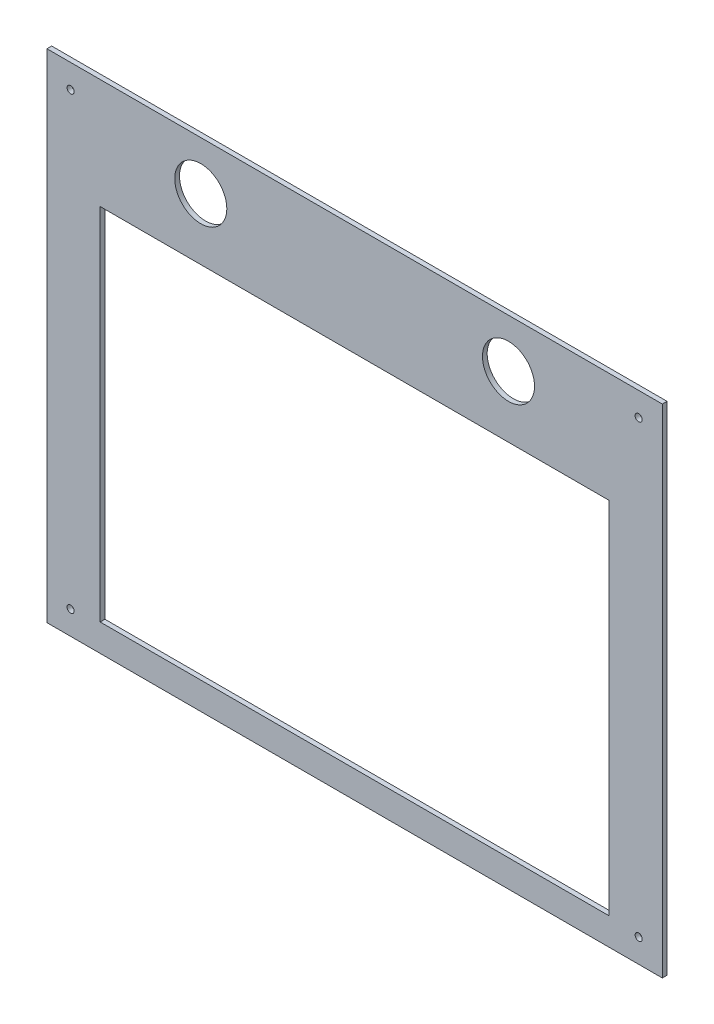
ISO-10303-21;
HEADER;
FILE_DESCRIPTION(('STEP AP214'),'2;1');
FILE_NAME('part.step','',(''),(''),'','','');
FILE_SCHEMA(('AUTOMOTIVE_DESIGN { 1 0 10303 214 1 1 1 1 }'));
ENDSEC;
DATA;
#1=APPLICATION_CONTEXT('core data for automotive mechanical design processes');
#2=APPLICATION_PROTOCOL_DEFINITION('international standard','automotive_design',2000,#1);
#3=PRODUCT_CONTEXT('',#1,'mechanical');
#4=PRODUCT('Part','Part','',(#3));
#5=PRODUCT_RELATED_PRODUCT_CATEGORY('part','',(#4));
#6=PRODUCT_DEFINITION_FORMATION('','',#4);
#7=PRODUCT_DEFINITION_CONTEXT('part definition',#1,'design');
#8=PRODUCT_DEFINITION('design','',#6,#7);
#9=PRODUCT_DEFINITION_SHAPE('','',#8);
#10=(LENGTH_UNIT() NAMED_UNIT(*) SI_UNIT(.MILLI.,.METRE.));
#11=(NAMED_UNIT(*) PLANE_ANGLE_UNIT() SI_UNIT($,.RADIAN.));
#12=(NAMED_UNIT(*) SI_UNIT($,.STERADIAN.) SOLID_ANGLE_UNIT());
#13=UNCERTAINTY_MEASURE_WITH_UNIT(LENGTH_MEASURE(1.E-05),#10,'distance_accuracy_value','');
#14=(GEOMETRIC_REPRESENTATION_CONTEXT(3) GLOBAL_UNCERTAINTY_ASSIGNED_CONTEXT((#13)) GLOBAL_UNIT_ASSIGNED_CONTEXT((#10,
#11,#12)) REPRESENTATION_CONTEXT('',''));
#15=CARTESIAN_POINT('',(0.,0.,0.));
#16=DIRECTION('',(0.,0.,1.));
#17=DIRECTION('',(1.,0.,0.));
#18=AXIS2_PLACEMENT_3D('',#15,#16,#17);
#19=CARTESIAN_POINT('',(0.,210.,2.));
#20=DIRECTION('',(1.,0.,0.));
#21=DIRECTION('',(0.,1.,0.));
#22=AXIS2_PLACEMENT_3D('',#19,#20,#21);
#23=PLANE('',#22);
#24=DIRECTION('',(0.,-1.,0.));
#25=VECTOR('',#24,1.);
#26=CARTESIAN_POINT('',(0.,210.,0.));
#27=LINE('',#26,#25);
#28=CARTESIAN_POINT('',(0.,210.,0.));
#29=VERTEX_POINT('',#28);
#30=CARTESIAN_POINT('',(0.,0.,0.));
#31=VERTEX_POINT('',#30);
#32=EDGE_CURVE('E152',#29,#31,#27,.T.);
#33=ORIENTED_EDGE('',*,*,#32,.T.);
#34=DIRECTION('',(0.,0.,-1.));
#35=VECTOR('',#34,1.);
#36=CARTESIAN_POINT('',(0.,0.,2.));
#37=LINE('',#36,#35);
#38=CARTESIAN_POINT('',(0.,0.,2.));
#39=VERTEX_POINT('',#38);
#40=EDGE_CURVE('E11',#39,#31,#37,.T.);
#41=ORIENTED_EDGE('',*,*,#40,.F.);
#42=DIRECTION('',(0.,-1.,0.));
#43=VECTOR('',#42,1.);
#44=CARTESIAN_POINT('',(0.,210.,2.));
#45=LINE('',#44,#43);
#46=CARTESIAN_POINT('',(0.,210.,2.));
#47=VERTEX_POINT('',#46);
#48=EDGE_CURVE('E155',#47,#39,#45,.T.);
#49=ORIENTED_EDGE('',*,*,#48,.F.);
#50=DIRECTION('',(0.,0.,-1.));
#51=VECTOR('',#50,1.);
#52=CARTESIAN_POINT('',(0.,210.,2.));
#53=LINE('',#52,#51);
#54=EDGE_CURVE('E165',#47,#29,#53,.T.);
#55=ORIENTED_EDGE('',*,*,#54,.T.);
#56=EDGE_LOOP('',(#33,#41,#49,#55));
#57=FACE_BOUND('',#56,.T.);
#58=ADVANCED_FACE('F36',(#57),#23,.F.);
#59=CARTESIAN_POINT('',(0.,0.,2.));
#60=DIRECTION('',(0.,1.,0.));
#61=DIRECTION('',(0.,0.,1.));
#62=AXIS2_PLACEMENT_3D('',#59,#60,#61);
#63=PLANE('',#62);
#64=DIRECTION('',(1.,0.,0.));
#65=VECTOR('',#64,1.);
#66=CARTESIAN_POINT('',(0.,0.,0.));
#67=LINE('',#66,#65);
#68=CARTESIAN_POINT('',(260.,0.,0.));
#69=VERTEX_POINT('',#68);
#70=EDGE_CURVE('E168',#31,#69,#67,.T.);
#71=ORIENTED_EDGE('',*,*,#70,.T.);
#72=DIRECTION('',(0.,0.,-1.));
#73=VECTOR('',#72,1.);
#74=CARTESIAN_POINT('',(260.,0.,2.));
#75=LINE('',#74,#73);
#76=CARTESIAN_POINT('',(260.,0.,2.));
#77=VERTEX_POINT('',#76);
#78=EDGE_CURVE('E44',#77,#69,#75,.T.);
#79=ORIENTED_EDGE('',*,*,#78,.F.);
#80=DIRECTION('',(1.,0.,0.));
#81=VECTOR('',#80,1.);
#82=CARTESIAN_POINT('',(0.,0.,2.));
#83=LINE('',#82,#81);
#84=EDGE_CURVE('E158',#39,#77,#83,.T.);
#85=ORIENTED_EDGE('',*,*,#84,.F.);
#86=ORIENTED_EDGE('',*,*,#40,.T.);
#87=EDGE_LOOP('',(#71,#79,#85,#86));
#88=FACE_BOUND('',#87,.T.);
#89=ADVANCED_FACE('F225',(#88),#63,.F.);
#90=CARTESIAN_POINT('',(260.,0.,2.));
#91=DIRECTION('',(-1.,0.,0.));
#92=DIRECTION('',(0.,0.,1.));
#93=AXIS2_PLACEMENT_3D('',#90,#91,#92);
#94=PLANE('',#93);
#95=DIRECTION('',(0.,1.,0.));
#96=VECTOR('',#95,1.);
#97=CARTESIAN_POINT('',(260.,0.,0.));
#98=LINE('',#97,#96);
#99=CARTESIAN_POINT('',(260.,210.,0.));
#100=VERTEX_POINT('',#99);
#101=EDGE_CURVE('E170',#69,#100,#98,.T.);
#102=ORIENTED_EDGE('',*,*,#101,.T.);
#103=DIRECTION('',(0.,0.,-1.));
#104=VECTOR('',#103,1.);
#105=CARTESIAN_POINT('',(260.,210.,2.));
#106=LINE('',#105,#104);
#107=CARTESIAN_POINT('',(260.,210.,2.));
#108=VERTEX_POINT('',#107);
#109=EDGE_CURVE('E175',#108,#100,#106,.T.);
#110=ORIENTED_EDGE('',*,*,#109,.F.);
#111=DIRECTION('',(0.,1.,0.));
#112=VECTOR('',#111,1.);
#113=CARTESIAN_POINT('',(260.,0.,2.));
#114=LINE('',#113,#112);
#115=EDGE_CURVE('E161',#77,#108,#114,.T.);
#116=ORIENTED_EDGE('',*,*,#115,.F.);
#117=ORIENTED_EDGE('',*,*,#78,.T.);
#118=EDGE_LOOP('',(#102,#110,#116,#117));
#119=FACE_BOUND('',#118,.T.);
#120=ADVANCED_FACE('F230',(#119),#94,.F.);
#121=CARTESIAN_POINT('',(260.,210.,2.));
#122=DIRECTION('',(0.,-1.,0.));
#123=DIRECTION('',(0.,0.,-1.));
#124=AXIS2_PLACEMENT_3D('',#121,#122,#123);
#125=PLANE('',#124);
#126=DIRECTION('',(-1.,0.,0.));
#127=VECTOR('',#126,1.);
#128=CARTESIAN_POINT('',(260.,210.,0.));
#129=LINE('',#128,#127);
#130=EDGE_CURVE('E159',#100,#29,#129,.T.);
#131=ORIENTED_EDGE('',*,*,#130,.T.);
#132=ORIENTED_EDGE('',*,*,#54,.F.);
#133=DIRECTION('',(-1.,0.,0.));
#134=VECTOR('',#133,1.);
#135=CARTESIAN_POINT('',(260.,210.,2.));
#136=LINE('',#135,#134);
#137=EDGE_CURVE('E163',#108,#47,#136,.T.);
#138=ORIENTED_EDGE('',*,*,#137,.F.);
#139=ORIENTED_EDGE('',*,*,#109,.T.);
#140=EDGE_LOOP('',(#131,#132,#138,#139));
#141=FACE_BOUND('',#140,.T.);
#142=ADVANCED_FACE('F208',(#141),#125,.F.);
#143=CARTESIAN_POINT('',(0.,0.,2.));
#144=DIRECTION('',(0.,0.,1.));
#145=DIRECTION('',(1.,0.,0.));
#146=AXIS2_PLACEMENT_3D('',#143,#144,#145);
#147=PLANE('',#146);
#148=CARTESIAN_POINT('',(250.,200.,2.));
#149=DIRECTION('',(0.,0.,1.));
#150=DIRECTION('',(1.,0.,0.));
#151=AXIS2_PLACEMENT_3D('',#148,#149,#150);
#152=CIRCLE('',#151,1.50000000000002);
#153=CARTESIAN_POINT('',(251.5,200.,2.));
#154=VERTEX_POINT('',#153);
#155=EDGE_CURVE('E193',#154,#154,#152,.T.);
#156=ORIENTED_EDGE('',*,*,#155,.F.);
#157=EDGE_LOOP('',(#156));
#158=FACE_BOUND('',#157,.T.);
#159=CARTESIAN_POINT('',(10.,200.,2.));
#160=DIRECTION('',(0.,0.,1.));
#161=DIRECTION('',(1.,0.,0.));
#162=AXIS2_PLACEMENT_3D('',#159,#160,#161);
#163=CIRCLE('',#162,1.5);
#164=CARTESIAN_POINT('',(11.5,200.,2.));
#165=VERTEX_POINT('',#164);
#166=EDGE_CURVE('E182',#165,#165,#163,.T.);
#167=ORIENTED_EDGE('',*,*,#166,.F.);
#168=EDGE_LOOP('',(#167));
#169=FACE_BOUND('',#168,.T.);
#170=CARTESIAN_POINT('',(9.99999999999998,10.,2.));
#171=DIRECTION('',(0.,0.,1.));
#172=DIRECTION('',(1.,0.,0.));
#173=AXIS2_PLACEMENT_3D('',#170,#171,#172);
#174=CIRCLE('',#173,1.5);
#175=CARTESIAN_POINT('',(11.5,10.,2.));
#176=VERTEX_POINT('',#175);
#177=EDGE_CURVE('E181',#176,#176,#174,.T.);
#178=ORIENTED_EDGE('',*,*,#177,.F.);
#179=EDGE_LOOP('',(#178));
#180=FACE_BOUND('',#179,.T.);
#181=CARTESIAN_POINT('',(250.,10.,2.));
#182=DIRECTION('',(0.,0.,1.));
#183=DIRECTION('',(1.,0.,0.));
#184=AXIS2_PLACEMENT_3D('',#181,#182,#183);
#185=CIRCLE('',#184,1.50000000000002);
#186=CARTESIAN_POINT('',(251.5,10.,2.));
#187=VERTEX_POINT('',#186);
#188=EDGE_CURVE('E124',#187,#187,#185,.T.);
#189=ORIENTED_EDGE('',*,*,#188,.F.);
#190=EDGE_LOOP('',(#189));
#191=FACE_BOUND('',#190,.T.);
#192=DIRECTION('',(1.,0.,0.));
#193=VECTOR('',#192,1.);
#194=CARTESIAN_POINT('',(130.,11.5102659824444,2.));
#195=LINE('',#194,#193);
#196=CARTESIAN_POINT('',(22.5,11.5102659824444,2.));
#197=VERTEX_POINT('',#196);
#198=CARTESIAN_POINT('',(237.5,11.5102659824444,2.));
#199=VERTEX_POINT('',#198);
#200=EDGE_CURVE('E106',#197,#199,#195,.T.);
#201=ORIENTED_EDGE('',*,*,#200,.F.);
#202=DIRECTION('',(0.,-1.,0.));
#203=VECTOR('',#202,1.);
#204=CARTESIAN_POINT('',(22.5,11.5102659824444,2.));
#205=LINE('',#204,#203);
#206=CARTESIAN_POINT('',(22.5,163.510265982444,2.));
#207=VERTEX_POINT('',#206);
#208=EDGE_CURVE('E121',#207,#197,#205,.T.);
#209=ORIENTED_EDGE('',*,*,#208,.F.);
#210=DIRECTION('',(-1.,0.,0.));
#211=VECTOR('',#210,1.);
#212=CARTESIAN_POINT('',(22.5,163.510265982444,2.));
#213=LINE('',#212,#211);
#214=CARTESIAN_POINT('',(237.5,163.510265982444,2.));
#215=VERTEX_POINT('',#214);
#216=EDGE_CURVE('E131',#215,#207,#213,.T.);
#217=ORIENTED_EDGE('',*,*,#216,.F.);
#218=DIRECTION('',(0.,1.,0.));
#219=VECTOR('',#218,1.);
#220=CARTESIAN_POINT('',(237.5,163.510265982444,2.));
#221=LINE('',#220,#219);
#222=EDGE_CURVE('E129',#199,#215,#221,.T.);
#223=ORIENTED_EDGE('',*,*,#222,.F.);
#224=EDGE_LOOP('',(#201,#209,#217,#223));
#225=FACE_BOUND('',#224,.T.);
#226=CARTESIAN_POINT('',(195.,189.471035353104,2.));
#227=DIRECTION('',(0.,0.,1.));
#228=DIRECTION('',(1.,0.,0.));
#229=AXIS2_PLACEMENT_3D('',#226,#227,#228);
#230=CIRCLE('',#229,11.);
#231=CARTESIAN_POINT('',(206.,189.471035353104,2.));
#232=VERTEX_POINT('',#231);
#233=EDGE_CURVE('E139',#232,#232,#230,.T.);
#234=ORIENTED_EDGE('',*,*,#233,.F.);
#235=EDGE_LOOP('',(#234));
#236=FACE_BOUND('',#235,.T.);
#237=CARTESIAN_POINT('',(65.,189.471035353104,2.));
#238=DIRECTION('',(0.,0.,1.));
#239=DIRECTION('',(1.,0.,0.));
#240=AXIS2_PLACEMENT_3D('',#237,#238,#239);
#241=CIRCLE('',#240,11.);
#242=CARTESIAN_POINT('',(76.,189.471035353104,2.));
#243=VERTEX_POINT('',#242);
#244=EDGE_CURVE('E146',#243,#243,#241,.T.);
#245=ORIENTED_EDGE('',*,*,#244,.F.);
#246=EDGE_LOOP('',(#245));
#247=FACE_BOUND('',#246,.T.);
#248=ORIENTED_EDGE('',*,*,#48,.T.);
#249=ORIENTED_EDGE('',*,*,#84,.T.);
#250=ORIENTED_EDGE('',*,*,#115,.T.);
#251=ORIENTED_EDGE('',*,*,#137,.T.);
#252=EDGE_LOOP('',(#248,#249,#250,#251));
#253=FACE_BOUND('',#252,.T.);
#254=ADVANCED_FACE('F205',(#158,#169,#180,#191,#225,#236,#247,#253),#147,.T.);
#255=CARTESIAN_POINT('',(0.,0.,0.));
#256=DIRECTION('',(0.,0.,1.));
#257=DIRECTION('',(1.,0.,0.));
#258=AXIS2_PLACEMENT_3D('',#255,#256,#257);
#259=PLANE('',#258);
#260=CARTESIAN_POINT('',(250.,200.,0.));
#261=DIRECTION('',(0.,0.,1.));
#262=DIRECTION('',(1.,0.,0.));
#263=AXIS2_PLACEMENT_3D('',#260,#261,#262);
#264=CIRCLE('',#263,1.50000000000002);
#265=CARTESIAN_POINT('',(251.5,200.,0.));
#266=VERTEX_POINT('',#265);
#267=EDGE_CURVE('E39',#266,#266,#264,.T.);
#268=ORIENTED_EDGE('',*,*,#267,.T.);
#269=EDGE_LOOP('',(#268));
#270=FACE_BOUND('',#269,.T.);
#271=CARTESIAN_POINT('',(10.,200.,0.));
#272=DIRECTION('',(0.,0.,1.));
#273=DIRECTION('',(1.,0.,0.));
#274=AXIS2_PLACEMENT_3D('',#271,#272,#273);
#275=CIRCLE('',#274,1.5);
#276=CARTESIAN_POINT('',(11.5,200.,0.));
#277=VERTEX_POINT('',#276);
#278=EDGE_CURVE('E179',#277,#277,#275,.T.);
#279=ORIENTED_EDGE('',*,*,#278,.T.);
#280=EDGE_LOOP('',(#279));
#281=FACE_BOUND('',#280,.T.);
#282=CARTESIAN_POINT('',(9.99999999999998,10.,0.));
#283=DIRECTION('',(0.,0.,1.));
#284=DIRECTION('',(1.,0.,0.));
#285=AXIS2_PLACEMENT_3D('',#282,#283,#284);
#286=CIRCLE('',#285,1.5);
#287=CARTESIAN_POINT('',(11.5,10.,0.));
#288=VERTEX_POINT('',#287);
#289=EDGE_CURVE('E186',#288,#288,#286,.T.);
#290=ORIENTED_EDGE('',*,*,#289,.T.);
#291=EDGE_LOOP('',(#290));
#292=FACE_BOUND('',#291,.T.);
#293=CARTESIAN_POINT('',(250.,10.,0.));
#294=DIRECTION('',(0.,0.,1.));
#295=DIRECTION('',(1.,0.,0.));
#296=AXIS2_PLACEMENT_3D('',#293,#294,#295);
#297=CIRCLE('',#296,1.50000000000002);
#298=CARTESIAN_POINT('',(251.5,10.,0.));
#299=VERTEX_POINT('',#298);
#300=EDGE_CURVE('E132',#299,#299,#297,.T.);
#301=ORIENTED_EDGE('',*,*,#300,.T.);
#302=EDGE_LOOP('',(#301));
#303=FACE_BOUND('',#302,.T.);
#304=DIRECTION('',(0.,-1.,0.));
#305=VECTOR('',#304,1.);
#306=CARTESIAN_POINT('',(22.5,11.5102659824444,0.));
#307=LINE('',#306,#305);
#308=CARTESIAN_POINT('',(22.5,163.510265982444,0.));
#309=VERTEX_POINT('',#308);
#310=CARTESIAN_POINT('',(22.5,11.5102659824444,0.));
#311=VERTEX_POINT('',#310);
#312=EDGE_CURVE('E109',#309,#311,#307,.T.);
#313=ORIENTED_EDGE('',*,*,#312,.T.);
#314=DIRECTION('',(1.,0.,0.));
#315=VECTOR('',#314,1.);
#316=CARTESIAN_POINT('',(237.5,11.5102659824444,0.));
#317=LINE('',#316,#315);
#318=CARTESIAN_POINT('',(237.5,11.5102659824444,0.));
#319=VERTEX_POINT('',#318);
#320=EDGE_CURVE('E103',#311,#319,#317,.T.);
#321=ORIENTED_EDGE('',*,*,#320,.T.);
#322=DIRECTION('',(0.,1.,0.));
#323=VECTOR('',#322,1.);
#324=CARTESIAN_POINT('',(237.5,163.510265982444,0.));
#325=LINE('',#324,#323);
#326=CARTESIAN_POINT('',(237.5,163.510265982444,0.));
#327=VERTEX_POINT('',#326);
#328=EDGE_CURVE('E112',#319,#327,#325,.T.);
#329=ORIENTED_EDGE('',*,*,#328,.T.);
#330=DIRECTION('',(-1.,0.,0.));
#331=VECTOR('',#330,1.);
#332=CARTESIAN_POINT('',(22.5,163.510265982444,0.));
#333=LINE('',#332,#331);
#334=EDGE_CURVE('E60',#327,#309,#333,.T.);
#335=ORIENTED_EDGE('',*,*,#334,.T.);
#336=EDGE_LOOP('',(#313,#321,#329,#335));
#337=FACE_BOUND('',#336,.T.);
#338=CARTESIAN_POINT('',(195.,189.471035353104,0.));
#339=DIRECTION('',(0.,0.,1.));
#340=DIRECTION('',(1.,0.,0.));
#341=AXIS2_PLACEMENT_3D('',#338,#339,#340);
#342=CIRCLE('',#341,11.);
#343=CARTESIAN_POINT('',(206.,189.471035353104,0.));
#344=VERTEX_POINT('',#343);
#345=EDGE_CURVE('E143',#344,#344,#342,.T.);
#346=ORIENTED_EDGE('',*,*,#345,.T.);
#347=EDGE_LOOP('',(#346));
#348=FACE_BOUND('',#347,.T.);
#349=CARTESIAN_POINT('',(65.,189.471035353104,0.));
#350=DIRECTION('',(0.,0.,1.));
#351=DIRECTION('',(1.,0.,0.));
#352=AXIS2_PLACEMENT_3D('',#349,#350,#351);
#353=CIRCLE('',#352,11.);
#354=CARTESIAN_POINT('',(76.,189.471035353104,0.));
#355=VERTEX_POINT('',#354);
#356=EDGE_CURVE('E149',#355,#355,#353,.T.);
#357=ORIENTED_EDGE('',*,*,#356,.T.);
#358=EDGE_LOOP('',(#357));
#359=FACE_BOUND('',#358,.T.);
#360=ORIENTED_EDGE('',*,*,#32,.F.);
#361=ORIENTED_EDGE('',*,*,#130,.F.);
#362=ORIENTED_EDGE('',*,*,#101,.F.);
#363=ORIENTED_EDGE('',*,*,#70,.F.);
#364=EDGE_LOOP('',(#360,#361,#362,#363));
#365=FACE_BOUND('',#364,.T.);
#366=ADVANCED_FACE('F117',(#270,#281,#292,#303,#337,#348,#359,#365),#259,.F.);
#367=CARTESIAN_POINT('',(65.,189.471035353104,0.));
#368=DIRECTION('',(0.,0.,1.));
#369=DIRECTION('',(1.,0.,0.));
#370=AXIS2_PLACEMENT_3D('',#367,#368,#369);
#371=CYLINDRICAL_SURFACE('',#370,11.);
#372=ORIENTED_EDGE('',*,*,#356,.F.);
#373=EDGE_LOOP('',(#372));
#374=FACE_BOUND('',#373,.T.);
#375=ORIENTED_EDGE('',*,*,#244,.T.);
#376=EDGE_LOOP('',(#375));
#377=FACE_BOUND('',#376,.T.);
#378=ADVANCED_FACE('F235',(#374,#377),#371,.F.);
#379=CARTESIAN_POINT('',(195.,189.471035353104,0.));
#380=DIRECTION('',(0.,0.,1.));
#381=DIRECTION('',(1.,0.,0.));
#382=AXIS2_PLACEMENT_3D('',#379,#380,#381);
#383=CYLINDRICAL_SURFACE('',#382,11.);
#384=ORIENTED_EDGE('',*,*,#345,.F.);
#385=EDGE_LOOP('',(#384));
#386=FACE_BOUND('',#385,.T.);
#387=ORIENTED_EDGE('',*,*,#233,.T.);
#388=EDGE_LOOP('',(#387));
#389=FACE_BOUND('',#388,.T.);
#390=ADVANCED_FACE('F241',(#386,#389),#383,.F.);
#391=CARTESIAN_POINT('',(130.,11.5102659824444,0.));
#392=DIRECTION('',(0.,-1.,0.));
#393=DIRECTION('',(1.,0.,0.));
#394=AXIS2_PLACEMENT_3D('',#391,#392,#393);
#395=PLANE('',#394);
#396=ORIENTED_EDGE('',*,*,#200,.T.);
#397=DIRECTION('',(0.,0.,1.));
#398=VECTOR('',#397,1.);
#399=CARTESIAN_POINT('',(237.5,11.5102659824444,0.));
#400=LINE('',#399,#398);
#401=EDGE_CURVE('E52',#319,#199,#400,.T.);
#402=ORIENTED_EDGE('',*,*,#401,.F.);
#403=ORIENTED_EDGE('',*,*,#320,.F.);
#404=DIRECTION('',(0.,0.,1.));
#405=VECTOR('',#404,1.);
#406=CARTESIAN_POINT('',(22.5,11.5102659824444,0.));
#407=LINE('',#406,#405);
#408=EDGE_CURVE('E137',#311,#197,#407,.T.);
#409=ORIENTED_EDGE('',*,*,#408,.T.);
#410=EDGE_LOOP('',(#396,#402,#403,#409));
#411=FACE_BOUND('',#410,.T.);
#412=ADVANCED_FACE('F101',(#411),#395,.F.);
#413=CARTESIAN_POINT('',(22.5,11.5102659824444,0.));
#414=DIRECTION('',(-1.,0.,0.));
#415=DIRECTION('',(0.,0.,1.));
#416=AXIS2_PLACEMENT_3D('',#413,#414,#415);
#417=PLANE('',#416);
#418=ORIENTED_EDGE('',*,*,#208,.T.);
#419=ORIENTED_EDGE('',*,*,#408,.F.);
#420=ORIENTED_EDGE('',*,*,#312,.F.);
#421=DIRECTION('',(0.,0.,1.));
#422=VECTOR('',#421,1.);
#423=CARTESIAN_POINT('',(22.5,163.510265982444,0.));
#424=LINE('',#423,#422);
#425=EDGE_CURVE('E140',#309,#207,#424,.T.);
#426=ORIENTED_EDGE('',*,*,#425,.T.);
#427=EDGE_LOOP('',(#418,#419,#420,#426));
#428=FACE_BOUND('',#427,.T.);
#429=ADVANCED_FACE('F307',(#428),#417,.F.);
#430=CARTESIAN_POINT('',(22.5,163.510265982444,0.));
#431=DIRECTION('',(0.,1.,0.));
#432=DIRECTION('',(0.,0.,1.));
#433=AXIS2_PLACEMENT_3D('',#430,#431,#432);
#434=PLANE('',#433);
#435=ORIENTED_EDGE('',*,*,#216,.T.);
#436=ORIENTED_EDGE('',*,*,#425,.F.);
#437=ORIENTED_EDGE('',*,*,#334,.F.);
#438=DIRECTION('',(0.,0.,1.));
#439=VECTOR('',#438,1.);
#440=CARTESIAN_POINT('',(237.5,163.510265982444,0.));
#441=LINE('',#440,#439);
#442=EDGE_CURVE('E108',#327,#215,#441,.T.);
#443=ORIENTED_EDGE('',*,*,#442,.T.);
#444=EDGE_LOOP('',(#435,#436,#437,#443));
#445=FACE_BOUND('',#444,.T.);
#446=ADVANCED_FACE('F310',(#445),#434,.F.);
#447=CARTESIAN_POINT('',(237.5,163.510265982444,0.));
#448=DIRECTION('',(1.,0.,0.));
#449=DIRECTION('',(0.,0.,-1.));
#450=AXIS2_PLACEMENT_3D('',#447,#448,#449);
#451=PLANE('',#450);
#452=ORIENTED_EDGE('',*,*,#222,.T.);
#453=ORIENTED_EDGE('',*,*,#442,.F.);
#454=ORIENTED_EDGE('',*,*,#328,.F.);
#455=ORIENTED_EDGE('',*,*,#401,.T.);
#456=EDGE_LOOP('',(#452,#453,#454,#455));
#457=FACE_BOUND('',#456,.T.);
#458=ADVANCED_FACE('F113',(#457),#451,.F.);
#459=CARTESIAN_POINT('',(250.,10.,0.));
#460=DIRECTION('',(0.,0.,1.));
#461=DIRECTION('',(1.,0.,0.));
#462=AXIS2_PLACEMENT_3D('',#459,#460,#461);
#463=CYLINDRICAL_SURFACE('',#462,1.50000000000002);
#464=ORIENTED_EDGE('',*,*,#300,.F.);
#465=EDGE_LOOP('',(#464));
#466=FACE_BOUND('',#465,.T.);
#467=ORIENTED_EDGE('',*,*,#188,.T.);
#468=EDGE_LOOP('',(#467));
#469=FACE_BOUND('',#468,.T.);
#470=ADVANCED_FACE('F203',(#466,#469),#463,.F.);
#471=CARTESIAN_POINT('',(9.99999999999998,10.,0.));
#472=DIRECTION('',(0.,0.,1.));
#473=DIRECTION('',(1.,0.,0.));
#474=AXIS2_PLACEMENT_3D('',#471,#472,#473);
#475=CYLINDRICAL_SURFACE('',#474,1.5);
#476=ORIENTED_EDGE('',*,*,#289,.F.);
#477=EDGE_LOOP('',(#476));
#478=FACE_BOUND('',#477,.T.);
#479=ORIENTED_EDGE('',*,*,#177,.T.);
#480=EDGE_LOOP('',(#479));
#481=FACE_BOUND('',#480,.T.);
#482=ADVANCED_FACE('F269',(#478,#481),#475,.F.);
#483=CARTESIAN_POINT('',(10.,200.,-8.));
#484=DIRECTION('',(0.,0.,1.));
#485=DIRECTION('',(1.,0.,0.));
#486=AXIS2_PLACEMENT_3D('',#483,#484,#485);
#487=CYLINDRICAL_SURFACE('',#486,1.5);
#488=ORIENTED_EDGE('',*,*,#166,.T.);
#489=EDGE_LOOP('',(#488));
#490=FACE_BOUND('',#489,.T.);
#491=ORIENTED_EDGE('',*,*,#278,.F.);
#492=EDGE_LOOP('',(#491));
#493=FACE_BOUND('',#492,.T.);
#494=ADVANCED_FACE('F279',(#490,#493),#487,.F.);
#495=CARTESIAN_POINT('',(250.,200.,-8.));
#496=DIRECTION('',(0.,0.,1.));
#497=DIRECTION('',(1.,0.,0.));
#498=AXIS2_PLACEMENT_3D('',#495,#496,#497);
#499=CYLINDRICAL_SURFACE('',#498,1.50000000000002);
#500=ORIENTED_EDGE('',*,*,#155,.T.);
#501=EDGE_LOOP('',(#500));
#502=FACE_BOUND('',#501,.T.);
#503=ORIENTED_EDGE('',*,*,#267,.F.);
#504=EDGE_LOOP('',(#503));
#505=FACE_BOUND('',#504,.T.);
#506=ADVANCED_FACE('F284',(#502,#505),#499,.F.);
#507=CLOSED_SHELL('',(#58,#89,#120,#142,#254,#366,#378,#390,#412,#429,#446,#458,#470,#482,#494,#506));
#508=MANIFOLD_SOLID_BREP('B2',#507);
#509=ADVANCED_BREP_SHAPE_REPRESENTATION('',(#18,#508),#14);
#510=SHAPE_DEFINITION_REPRESENTATION(#9,#509);
ENDSEC;
END-ISO-10303-21;
